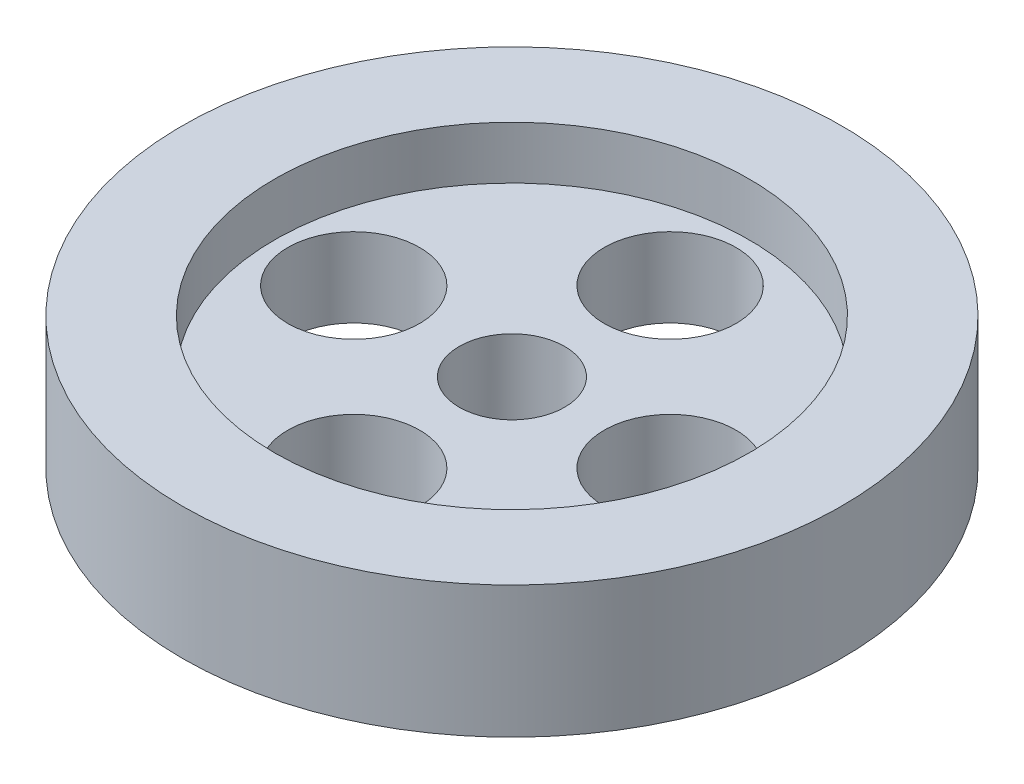
ISO-10303-21;
HEADER;
FILE_DESCRIPTION(('STEP AP214'),'2;1');
FILE_NAME('part.step','',(''),(''),'','','');
FILE_SCHEMA(('AUTOMOTIVE_DESIGN { 1 0 10303 214 1 1 1 1 }'));
ENDSEC;
DATA;
#1=APPLICATION_CONTEXT('core data for automotive mechanical design processes');
#2=APPLICATION_PROTOCOL_DEFINITION('international standard','automotive_design',2000,#1);
#3=PRODUCT_CONTEXT('',#1,'mechanical');
#4=PRODUCT('Part','Part','',(#3));
#5=PRODUCT_RELATED_PRODUCT_CATEGORY('part','',(#4));
#6=PRODUCT_DEFINITION_FORMATION('','',#4);
#7=PRODUCT_DEFINITION_CONTEXT('part definition',#1,'design');
#8=PRODUCT_DEFINITION('design','',#6,#7);
#9=PRODUCT_DEFINITION_SHAPE('','',#8);
#10=(LENGTH_UNIT() NAMED_UNIT(*) SI_UNIT(.MILLI.,.METRE.));
#11=(NAMED_UNIT(*) PLANE_ANGLE_UNIT() SI_UNIT($,.RADIAN.));
#12=(NAMED_UNIT(*) SI_UNIT($,.STERADIAN.) SOLID_ANGLE_UNIT());
#13=UNCERTAINTY_MEASURE_WITH_UNIT(LENGTH_MEASURE(1.E-05),#10,'distance_accuracy_value','');
#14=(GEOMETRIC_REPRESENTATION_CONTEXT(3) GLOBAL_UNCERTAINTY_ASSIGNED_CONTEXT((#13)) GLOBAL_UNIT_ASSIGNED_CONTEXT((#10,
#11,#12)) REPRESENTATION_CONTEXT('',''));
#15=CARTESIAN_POINT('',(0.,0.,0.));
#16=DIRECTION('',(0.,0.,1.));
#17=DIRECTION('',(1.,0.,0.));
#18=AXIS2_PLACEMENT_3D('',#15,#16,#17);
#19=CARTESIAN_POINT('',(0.,10.,0.));
#20=DIRECTION('',(0.,-1.,0.));
#21=DIRECTION('',(0.,0.,-1.));
#22=AXIS2_PLACEMENT_3D('',#19,#20,#21);
#23=CYLINDRICAL_SURFACE('',#22,4.);
#24=CARTESIAN_POINT('',(0.,6.,0.));
#25=DIRECTION('',(0.,1.,0.));
#26=DIRECTION('',(0.,0.,1.));
#27=AXIS2_PLACEMENT_3D('',#24,#25,#26);
#28=CIRCLE('',#27,4.);
#29=CARTESIAN_POINT('',(0.,6.,4.));
#30=VERTEX_POINT('',#29);
#31=EDGE_CURVE('E65',#30,#30,#28,.T.);
#32=ORIENTED_EDGE('',*,*,#31,.T.);
#33=EDGE_LOOP('',(#32));
#34=FACE_BOUND('',#33,.T.);
#35=CARTESIAN_POINT('',(0.,-1.,0.));
#36=DIRECTION('',(0.,-1.,0.));
#37=DIRECTION('',(0.,0.,-1.));
#38=AXIS2_PLACEMENT_3D('',#35,#36,#37);
#39=CIRCLE('',#38,4.);
#40=CARTESIAN_POINT('',(0.,-1.,-4.));
#41=VERTEX_POINT('',#40);
#42=EDGE_CURVE('E35',#41,#41,#39,.T.);
#43=ORIENTED_EDGE('',*,*,#42,.T.);
#44=EDGE_LOOP('',(#43));
#45=FACE_BOUND('',#44,.T.);
#46=ADVANCED_FACE('F31',(#34,#45),#23,.F.);
#47=CARTESIAN_POINT('',(0.,10.,-12.));
#48=DIRECTION('',(0.,-1.,0.));
#49=DIRECTION('',(0.,0.,-1.));
#50=AXIS2_PLACEMENT_3D('',#47,#48,#49);
#51=CYLINDRICAL_SURFACE('',#50,5.);
#52=CARTESIAN_POINT('',(0.,0.,-12.));
#53=DIRECTION('',(0.,1.,0.));
#54=DIRECTION('',(0.,0.,1.));
#55=AXIS2_PLACEMENT_3D('',#52,#53,#54);
#56=CIRCLE('',#55,5.);
#57=CARTESIAN_POINT('',(0.,0.,-7.));
#58=VERTEX_POINT('',#57);
#59=EDGE_CURVE('E52',#58,#58,#56,.T.);
#60=ORIENTED_EDGE('',*,*,#59,.F.);
#61=EDGE_LOOP('',(#60));
#62=FACE_BOUND('',#61,.T.);
#63=CARTESIAN_POINT('',(0.,6.,-12.));
#64=DIRECTION('',(0.,1.,0.));
#65=DIRECTION('',(0.,0.,1.));
#66=AXIS2_PLACEMENT_3D('',#63,#64,#65);
#67=CIRCLE('',#66,5.);
#68=CARTESIAN_POINT('',(0.,6.,-7.));
#69=VERTEX_POINT('',#68);
#70=EDGE_CURVE('E68',#69,#69,#67,.T.);
#71=ORIENTED_EDGE('',*,*,#70,.T.);
#72=EDGE_LOOP('',(#71));
#73=FACE_BOUND('',#72,.T.);
#74=ADVANCED_FACE('F104',(#62,#73),#51,.F.);
#75=CARTESIAN_POINT('',(12.,10.,0.));
#76=DIRECTION('',(0.,-1.,0.));
#77=DIRECTION('',(0.,0.,-1.));
#78=AXIS2_PLACEMENT_3D('',#75,#76,#77);
#79=CYLINDRICAL_SURFACE('',#78,5.);
#80=CARTESIAN_POINT('',(12.,0.,0.));
#81=DIRECTION('',(0.,1.,0.));
#82=DIRECTION('',(0.,0.,1.));
#83=AXIS2_PLACEMENT_3D('',#80,#81,#82);
#84=CIRCLE('',#83,5.);
#85=CARTESIAN_POINT('',(12.,0.,5.00000000000004));
#86=VERTEX_POINT('',#85);
#87=EDGE_CURVE('E56',#86,#86,#84,.T.);
#88=ORIENTED_EDGE('',*,*,#87,.F.);
#89=EDGE_LOOP('',(#88));
#90=FACE_BOUND('',#89,.T.);
#91=CARTESIAN_POINT('',(12.,6.,0.));
#92=DIRECTION('',(0.,1.,0.));
#93=DIRECTION('',(0.,0.,1.));
#94=AXIS2_PLACEMENT_3D('',#91,#92,#93);
#95=CIRCLE('',#94,5.);
#96=CARTESIAN_POINT('',(12.,6.,5.00000000000004));
#97=VERTEX_POINT('',#96);
#98=EDGE_CURVE('E71',#97,#97,#95,.T.);
#99=ORIENTED_EDGE('',*,*,#98,.T.);
#100=EDGE_LOOP('',(#99));
#101=FACE_BOUND('',#100,.T.);
#102=ADVANCED_FACE('F110',(#90,#101),#79,.F.);
#103=CARTESIAN_POINT('',(6.77712297852766E-13,10.,12.));
#104=DIRECTION('',(0.,-1.,0.));
#105=DIRECTION('',(0.,0.,-1.));
#106=AXIS2_PLACEMENT_3D('',#103,#104,#105);
#107=CYLINDRICAL_SURFACE('',#106,5.00000000000073);
#108=CARTESIAN_POINT('',(6.77712297852766E-13,0.,12.));
#109=DIRECTION('',(0.,1.,0.));
#110=DIRECTION('',(0.,0.,1.));
#111=AXIS2_PLACEMENT_3D('',#108,#109,#110);
#112=CIRCLE('',#111,5.00000000000073);
#113=CARTESIAN_POINT('',(6.77712297852766E-13,0.,17.0000000000007));
#114=VERTEX_POINT('',#113);
#115=EDGE_CURVE('E59',#114,#114,#112,.T.);
#116=ORIENTED_EDGE('',*,*,#115,.F.);
#117=EDGE_LOOP('',(#116));
#118=FACE_BOUND('',#117,.T.);
#119=CARTESIAN_POINT('',(6.77712297852766E-13,6.,12.));
#120=DIRECTION('',(0.,1.,0.));
#121=DIRECTION('',(0.,0.,1.));
#122=AXIS2_PLACEMENT_3D('',#119,#120,#121);
#123=CIRCLE('',#122,5.00000000000073);
#124=CARTESIAN_POINT('',(6.77712297852766E-13,6.,17.0000000000007));
#125=VERTEX_POINT('',#124);
#126=EDGE_CURVE('E49',#125,#125,#123,.T.);
#127=ORIENTED_EDGE('',*,*,#126,.T.);
#128=EDGE_LOOP('',(#127));
#129=FACE_BOUND('',#128,.T.);
#130=ADVANCED_FACE('F139',(#118,#129),#107,.F.);
#131=CARTESIAN_POINT('',(-11.9999999999997,10.,3.4032572508536E-13));
#132=DIRECTION('',(0.,-1.,0.));
#133=DIRECTION('',(0.,0.,-1.));
#134=AXIS2_PLACEMENT_3D('',#131,#132,#133);
#135=CYLINDRICAL_SURFACE('',#134,5.00000000000055);
#136=CARTESIAN_POINT('',(-11.9999999999997,0.,3.4032572508536E-13));
#137=DIRECTION('',(0.,1.,0.));
#138=DIRECTION('',(0.,0.,1.));
#139=AXIS2_PLACEMENT_3D('',#136,#137,#138);
#140=CIRCLE('',#139,5.00000000000055);
#141=CARTESIAN_POINT('',(-11.9999999999997,0.,5.00000000000089));
#142=VERTEX_POINT('',#141);
#143=EDGE_CURVE('E62',#142,#142,#140,.T.);
#144=ORIENTED_EDGE('',*,*,#143,.F.);
#145=EDGE_LOOP('',(#144));
#146=FACE_BOUND('',#145,.T.);
#147=CARTESIAN_POINT('',(-11.9999999999997,6.,3.4032572508536E-13));
#148=DIRECTION('',(0.,1.,0.));
#149=DIRECTION('',(0.,0.,1.));
#150=AXIS2_PLACEMENT_3D('',#147,#148,#149);
#151=CIRCLE('',#150,5.00000000000055);
#152=CARTESIAN_POINT('',(-11.9999999999997,6.,5.00000000000089));
#153=VERTEX_POINT('',#152);
#154=EDGE_CURVE('E46',#153,#153,#151,.T.);
#155=ORIENTED_EDGE('',*,*,#154,.T.);
#156=EDGE_LOOP('',(#155));
#157=FACE_BOUND('',#156,.T.);
#158=ADVANCED_FACE('F118',(#146,#157),#135,.F.);
#159=CARTESIAN_POINT('',(0.,10.,0.));
#160=DIRECTION('',(0.,1.,0.));
#161=DIRECTION('',(0.,0.,1.));
#162=AXIS2_PLACEMENT_3D('',#159,#160,#161);
#163=PLANE('',#162);
#164=CARTESIAN_POINT('',(0.,10.,0.));
#165=DIRECTION('',(0.,1.,0.));
#166=DIRECTION('',(0.,0.,1.));
#167=AXIS2_PLACEMENT_3D('',#164,#165,#166);
#168=CIRCLE('',#167,18.);
#169=CARTESIAN_POINT('',(0.,10.,18.));
#170=VERTEX_POINT('',#169);
#171=EDGE_CURVE('E76',#170,#170,#168,.T.);
#172=ORIENTED_EDGE('',*,*,#171,.F.);
#173=EDGE_LOOP('',(#172));
#174=FACE_BOUND('',#173,.T.);
#175=CARTESIAN_POINT('',(0.,10.,0.));
#176=DIRECTION('',(0.,1.,0.));
#177=DIRECTION('',(0.,0.,1.));
#178=AXIS2_PLACEMENT_3D('',#175,#176,#177);
#179=CIRCLE('',#178,25.);
#180=CARTESIAN_POINT('',(0.,10.,25.));
#181=VERTEX_POINT('',#180);
#182=EDGE_CURVE('E39',#181,#181,#179,.T.);
#183=ORIENTED_EDGE('',*,*,#182,.T.);
#184=EDGE_LOOP('',(#183));
#185=FACE_BOUND('',#184,.T.);
#186=ADVANCED_FACE('F115',(#174,#185),#163,.T.);
#187=CARTESIAN_POINT('',(0.,0.,0.));
#188=DIRECTION('',(0.,1.,0.));
#189=DIRECTION('',(0.,0.,1.));
#190=AXIS2_PLACEMENT_3D('',#187,#188,#189);
#191=PLANE('',#190);
#192=CARTESIAN_POINT('',(0.,0.,0.));
#193=DIRECTION('',(0.,1.,0.));
#194=DIRECTION('',(0.,0.,1.));
#195=AXIS2_PLACEMENT_3D('',#192,#193,#194);
#196=CIRCLE('',#195,6.);
#197=CARTESIAN_POINT('',(0.,0.,6.));
#198=VERTEX_POINT('',#197);
#199=EDGE_CURVE('E10',#198,#198,#196,.F.);
#200=ORIENTED_EDGE('',*,*,#199,.F.);
#201=EDGE_LOOP('',(#200));
#202=FACE_BOUND('',#201,.T.);
#203=CARTESIAN_POINT('',(0.,0.,0.));
#204=DIRECTION('',(0.,1.,0.));
#205=DIRECTION('',(0.,0.,1.));
#206=AXIS2_PLACEMENT_3D('',#203,#204,#205);
#207=CIRCLE('',#206,25.);
#208=CARTESIAN_POINT('',(0.,0.,25.));
#209=VERTEX_POINT('',#208);
#210=EDGE_CURVE('E43',#209,#209,#207,.T.);
#211=ORIENTED_EDGE('',*,*,#210,.F.);
#212=EDGE_LOOP('',(#211));
#213=FACE_BOUND('',#212,.T.);
#214=ORIENTED_EDGE('',*,*,#59,.T.);
#215=EDGE_LOOP('',(#214));
#216=FACE_BOUND('',#215,.T.);
#217=ORIENTED_EDGE('',*,*,#87,.T.);
#218=EDGE_LOOP('',(#217));
#219=FACE_BOUND('',#218,.T.);
#220=ORIENTED_EDGE('',*,*,#115,.T.);
#221=EDGE_LOOP('',(#220));
#222=FACE_BOUND('',#221,.T.);
#223=ORIENTED_EDGE('',*,*,#143,.T.);
#224=EDGE_LOOP('',(#223));
#225=FACE_BOUND('',#224,.T.);
#226=ADVANCED_FACE('F117',(#202,#213,#216,#219,#222,#225),#191,.F.);
#227=CARTESIAN_POINT('',(0.,10.,0.));
#228=DIRECTION('',(0.,-1.,0.));
#229=DIRECTION('',(0.,0.,-1.));
#230=AXIS2_PLACEMENT_3D('',#227,#228,#229);
#231=CYLINDRICAL_SURFACE('',#230,25.);
#232=ORIENTED_EDGE('',*,*,#182,.F.);
#233=EDGE_LOOP('',(#232));
#234=FACE_BOUND('',#233,.T.);
#235=ORIENTED_EDGE('',*,*,#210,.T.);
#236=EDGE_LOOP('',(#235));
#237=FACE_BOUND('',#236,.T.);
#238=ADVANCED_FACE('F33',(#234,#237),#231,.T.);
#239=CARTESIAN_POINT('',(0.,6.,0.));
#240=DIRECTION('',(0.,1.,0.));
#241=DIRECTION('',(0.,0.,1.));
#242=AXIS2_PLACEMENT_3D('',#239,#240,#241);
#243=CYLINDRICAL_SURFACE('',#242,18.);
#244=CARTESIAN_POINT('',(0.,6.,0.));
#245=DIRECTION('',(0.,1.,0.));
#246=DIRECTION('',(0.,0.,1.));
#247=AXIS2_PLACEMENT_3D('',#244,#245,#246);
#248=CIRCLE('',#247,18.);
#249=CARTESIAN_POINT('',(0.,6.,18.));
#250=VERTEX_POINT('',#249);
#251=EDGE_CURVE('E50',#250,#250,#248,.T.);
#252=ORIENTED_EDGE('',*,*,#251,.F.);
#253=EDGE_LOOP('',(#252));
#254=FACE_BOUND('',#253,.T.);
#255=ORIENTED_EDGE('',*,*,#171,.T.);
#256=EDGE_LOOP('',(#255));
#257=FACE_BOUND('',#256,.T.);
#258=ADVANCED_FACE('F100',(#254,#257),#243,.F.);
#259=CARTESIAN_POINT('',(0.,6.,0.));
#260=DIRECTION('',(0.,1.,0.));
#261=DIRECTION('',(0.,0.,1.));
#262=AXIS2_PLACEMENT_3D('',#259,#260,#261);
#263=PLANE('',#262);
#264=ORIENTED_EDGE('',*,*,#31,.F.);
#265=EDGE_LOOP('',(#264));
#266=FACE_BOUND('',#265,.T.);
#267=ORIENTED_EDGE('',*,*,#70,.F.);
#268=EDGE_LOOP('',(#267));
#269=FACE_BOUND('',#268,.T.);
#270=ORIENTED_EDGE('',*,*,#98,.F.);
#271=EDGE_LOOP('',(#270));
#272=FACE_BOUND('',#271,.T.);
#273=ORIENTED_EDGE('',*,*,#126,.F.);
#274=EDGE_LOOP('',(#273));
#275=FACE_BOUND('',#274,.T.);
#276=ORIENTED_EDGE('',*,*,#154,.F.);
#277=EDGE_LOOP('',(#276));
#278=FACE_BOUND('',#277,.T.);
#279=ORIENTED_EDGE('',*,*,#251,.T.);
#280=EDGE_LOOP('',(#279));
#281=FACE_BOUND('',#280,.T.);
#282=ADVANCED_FACE('F92',(#266,#269,#272,#275,#278,#281),#263,.T.);
#283=CARTESIAN_POINT('',(0.,-1.,0.));
#284=DIRECTION('',(0.,-1.,0.));
#285=DIRECTION('',(0.,0.,-1.));
#286=AXIS2_PLACEMENT_3D('',#283,#284,#285);
#287=PLANE('',#286);
#288=ORIENTED_EDGE('',*,*,#42,.F.);
#289=EDGE_LOOP('',(#288));
#290=FACE_BOUND('',#289,.T.);
#291=CARTESIAN_POINT('',(0.,-1.,0.));
#292=DIRECTION('',(0.,-1.,0.));
#293=DIRECTION('',(0.,0.,-1.));
#294=AXIS2_PLACEMENT_3D('',#291,#292,#293);
#295=CIRCLE('',#294,6.);
#296=CARTESIAN_POINT('',(0.,-1.,-6.));
#297=VERTEX_POINT('',#296);
#298=EDGE_CURVE('E79',#297,#297,#295,.T.);
#299=ORIENTED_EDGE('',*,*,#298,.T.);
#300=EDGE_LOOP('',(#299));
#301=FACE_BOUND('',#300,.T.);
#302=ADVANCED_FACE('F89',(#290,#301),#287,.T.);
#303=CARTESIAN_POINT('',(0.,-1.,0.));
#304=DIRECTION('',(0.,1.,0.));
#305=DIRECTION('',(0.,0.,1.));
#306=AXIS2_PLACEMENT_3D('',#303,#304,#305);
#307=CYLINDRICAL_SURFACE('',#306,6.);
#308=ORIENTED_EDGE('',*,*,#298,.F.);
#309=EDGE_LOOP('',(#308));
#310=FACE_BOUND('',#309,.T.);
#311=ORIENTED_EDGE('',*,*,#199,.T.);
#312=EDGE_LOOP('',(#311));
#313=FACE_BOUND('',#312,.T.);
#314=ADVANCED_FACE('F91',(#310,#313),#307,.T.);
#315=CLOSED_SHELL('',(#46,#74,#102,#130,#158,#186,#226,#238,#258,#282,#302,#314));
#316=MANIFOLD_SOLID_BREP('B2',#315);
#317=ADVANCED_BREP_SHAPE_REPRESENTATION('',(#18,#316),#14);
#318=SHAPE_DEFINITION_REPRESENTATION(#9,#317);
ENDSEC;
END-ISO-10303-21;
